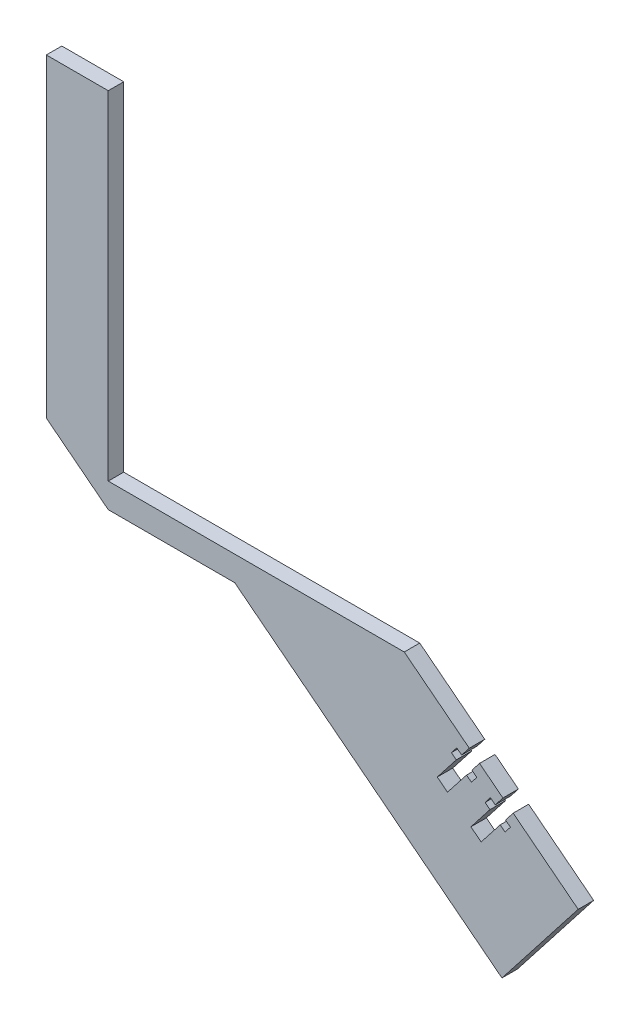
ISO-10303-21;
HEADER;
FILE_DESCRIPTION(('STEP AP214'),'2;1');
FILE_NAME('part.step','',(''),(''),'','','');
FILE_SCHEMA(('AUTOMOTIVE_DESIGN { 1 0 10303 214 1 1 1 1 }'));
ENDSEC;
DATA;
#1=APPLICATION_CONTEXT('core data for automotive mechanical design processes');
#2=APPLICATION_PROTOCOL_DEFINITION('international standard','automotive_design',2000,#1);
#3=PRODUCT_CONTEXT('',#1,'mechanical');
#4=PRODUCT('Part','Part','',(#3));
#5=PRODUCT_RELATED_PRODUCT_CATEGORY('part','',(#4));
#6=PRODUCT_DEFINITION_FORMATION('','',#4);
#7=PRODUCT_DEFINITION_CONTEXT('part definition',#1,'design');
#8=PRODUCT_DEFINITION('design','',#6,#7);
#9=PRODUCT_DEFINITION_SHAPE('','',#8);
#10=(LENGTH_UNIT() NAMED_UNIT(*) SI_UNIT(.MILLI.,.METRE.));
#11=(NAMED_UNIT(*) PLANE_ANGLE_UNIT() SI_UNIT($,.RADIAN.));
#12=(NAMED_UNIT(*) SI_UNIT($,.STERADIAN.) SOLID_ANGLE_UNIT());
#13=UNCERTAINTY_MEASURE_WITH_UNIT(LENGTH_MEASURE(1.E-05),#10,'distance_accuracy_value','');
#14=(GEOMETRIC_REPRESENTATION_CONTEXT(3) GLOBAL_UNCERTAINTY_ASSIGNED_CONTEXT((#13)) GLOBAL_UNIT_ASSIGNED_CONTEXT((#10,
#11,#12)) REPRESENTATION_CONTEXT('',''));
#15=CARTESIAN_POINT('',(0.,0.,0.));
#16=DIRECTION('',(0.,0.,1.));
#17=DIRECTION('',(1.,0.,0.));
#18=AXIS2_PLACEMENT_3D('',#15,#16,#17);
#19=CARTESIAN_POINT('',(-331.826668728988,452.478862829645,-222.99999999963));
#20=DIRECTION('',(0.615661475325659,0.788010753606722,0.));
#21=DIRECTION('',(-0.788010753606722,0.615661475325659,0.));
#22=AXIS2_PLACEMENT_3D('',#19,#20,#21);
#23=PLANE('',#22);
#24=DIRECTION('',(0.,0.,-1.));
#25=VECTOR('',#24,1.);
#26=CARTESIAN_POINT('',(-307.516612196294,433.485765081086,-217.99999999963));
#27=LINE('',#26,#25);
#28=CARTESIAN_POINT('',(-307.516612196294,433.485765081086,-217.99999999963));
#29=VERTEX_POINT('',#28);
#30=CARTESIAN_POINT('',(-307.516612196294,433.485765081086,-222.99999999963));
#31=VERTEX_POINT('',#30);
#32=EDGE_CURVE('E300',#29,#31,#27,.T.);
#33=ORIENTED_EDGE('',*,*,#32,.F.);
#34=DIRECTION('',(-0.788010753606722,0.615661475325659,0.));
#35=VECTOR('',#34,1.);
#36=CARTESIAN_POINT('',(-331.826668728988,452.478862829645,-217.99999999963));
#37=LINE('',#36,#35);
#38=CARTESIAN_POINT('',(-299.957265680182,427.579756302264,-217.99999999963));
#39=VERTEX_POINT('',#38);
#40=EDGE_CURVE('E273',#39,#29,#37,.T.);
#41=ORIENTED_EDGE('',*,*,#40,.F.);
#42=DIRECTION('',(0.,0.,-1.));
#43=VECTOR('',#42,1.);
#44=CARTESIAN_POINT('',(-299.957265680182,427.579756302264,-217.99999999963));
#45=LINE('',#44,#43);
#46=CARTESIAN_POINT('',(-299.957265680182,427.579756302264,-222.99999999963));
#47=VERTEX_POINT('',#46);
#48=EDGE_CURVE('E364',#39,#47,#45,.T.);
#49=ORIENTED_EDGE('',*,*,#48,.T.);
#50=DIRECTION('',(-0.788010753606722,0.615661475325659,0.));
#51=VECTOR('',#50,1.);
#52=CARTESIAN_POINT('',(-331.826668728988,452.478862829645,-222.99999999963));
#53=LINE('',#52,#51);
#54=EDGE_CURVE('E467',#47,#31,#53,.T.);
#55=ORIENTED_EDGE('',*,*,#54,.T.);
#56=EDGE_LOOP('',(#33,#41,#49,#55));
#57=FACE_BOUND('',#56,.T.);
#58=ADVANCED_FACE('F33',(#57),#23,.T.);
#59=DIRECTION('',(0.,0.,-1.));
#60=VECTOR('',#59,1.);
#61=CARTESIAN_POINT('',(-296.647620515035,424.993978105897,-217.99999999963));
#62=LINE('',#61,#60);
#63=CARTESIAN_POINT('',(-296.647620515035,424.993978105897,-217.99999999963));
#64=VERTEX_POINT('',#63);
#65=CARTESIAN_POINT('',(-296.647620515035,424.993978105897,-222.99999999963));
#66=VERTEX_POINT('',#65);
#67=EDGE_CURVE('E361',#64,#66,#62,.T.);
#68=ORIENTED_EDGE('',*,*,#67,.F.);
#69=CARTESIAN_POINT('',(-275.647209147489,408.586658553705,-217.99999999963));
#70=VERTEX_POINT('',#69);
#71=EDGE_CURVE('E442',#70,#64,#37,.T.);
#72=ORIENTED_EDGE('',*,*,#71,.F.);
#73=DIRECTION('',(0.,0.,1.));
#74=VECTOR('',#73,1.);
#75=CARTESIAN_POINT('',(-275.647209147489,408.586658553705,-222.99999999963));
#76=LINE('',#75,#74);
#77=CARTESIAN_POINT('',(-275.647209147489,408.586658553705,-222.99999999963));
#78=VERTEX_POINT('',#77);
#79=EDGE_CURVE('E42',#78,#70,#76,.T.);
#80=ORIENTED_EDGE('',*,*,#79,.F.);
#81=EDGE_CURVE('E464',#78,#66,#53,.T.);
#82=ORIENTED_EDGE('',*,*,#81,.T.);
#83=EDGE_LOOP('',(#68,#72,#80,#82));
#84=FACE_BOUND('',#83,.T.);
#85=ADVANCED_FACE('F549',(#84),#23,.T.);
#86=CARTESIAN_POINT('',(-331.826668728988,452.478862829645,-222.99999999963));
#87=DIRECTION('',(0.,1.,0.));
#88=DIRECTION('',(0.,0.,1.));
#89=AXIS2_PLACEMENT_3D('',#86,#87,#88);
#90=PLANE('',#89);
#91=DIRECTION('',(-1.,0.,0.));
#92=VECTOR('',#91,1.);
#93=CARTESIAN_POINT('',(-331.826668728988,452.478862829645,-217.99999999963));
#94=LINE('',#93,#92);
#95=CARTESIAN_POINT('',(-331.826668728988,452.478862829645,-217.99999999963));
#96=VERTEX_POINT('',#95);
#97=CARTESIAN_POINT('',(-427.432442284142,452.478862829645,-217.99999999963));
#98=VERTEX_POINT('',#97);
#99=EDGE_CURVE('E437',#96,#98,#94,.T.);
#100=ORIENTED_EDGE('',*,*,#99,.F.);
#101=DIRECTION('',(0.,0.,1.));
#102=VECTOR('',#101,1.);
#103=CARTESIAN_POINT('',(-331.826668728988,452.478862829645,-222.99999999963));
#104=LINE('',#103,#102);
#105=CARTESIAN_POINT('',(-331.826668728988,452.478862829645,-222.99999999963));
#106=VERTEX_POINT('',#105);
#107=EDGE_CURVE('E11',#106,#96,#104,.T.);
#108=ORIENTED_EDGE('',*,*,#107,.F.);
#109=DIRECTION('',(-1.,0.,0.));
#110=VECTOR('',#109,1.);
#111=CARTESIAN_POINT('',(-331.826668728988,452.478862829645,-222.99999999963));
#112=LINE('',#111,#110);
#113=CARTESIAN_POINT('',(-427.432442284142,452.478862829645,-222.99999999963));
#114=VERTEX_POINT('',#113);
#115=EDGE_CURVE('E438',#106,#114,#112,.T.);
#116=ORIENTED_EDGE('',*,*,#115,.T.);
#117=DIRECTION('',(0.,0.,1.));
#118=VECTOR('',#117,1.);
#119=CARTESIAN_POINT('',(-427.432442284142,452.478862829645,-222.99999999963));
#120=LINE('',#119,#118);
#121=EDGE_CURVE('E37',#114,#98,#120,.T.);
#122=ORIENTED_EDGE('',*,*,#121,.T.);
#123=EDGE_LOOP('',(#100,#108,#116,#122));
#124=FACE_BOUND('',#123,.T.);
#125=ADVANCED_FACE('F35',(#124),#90,.T.);
#126=DIRECTION('',(0.,0.,-1.));
#127=VECTOR('',#126,1.);
#128=CARTESIAN_POINT('',(-310.826257361443,436.071543277454,-217.99999999963));
#129=LINE('',#128,#127);
#130=CARTESIAN_POINT('',(-310.826257361443,436.071543277454,-217.99999999963));
#131=VERTEX_POINT('',#130);
#132=CARTESIAN_POINT('',(-310.826257361443,436.071543277454,-222.99999999963));
#133=VERTEX_POINT('',#132);
#134=EDGE_CURVE('E303',#131,#133,#129,.T.);
#135=ORIENTED_EDGE('',*,*,#134,.T.);
#136=EDGE_CURVE('E463',#133,#106,#53,.T.);
#137=ORIENTED_EDGE('',*,*,#136,.T.);
#138=ORIENTED_EDGE('',*,*,#107,.T.);
#139=EDGE_CURVE('E491',#131,#96,#37,.T.);
#140=ORIENTED_EDGE('',*,*,#139,.F.);
#141=EDGE_LOOP('',(#135,#137,#138,#140));
#142=FACE_BOUND('',#141,.T.);
#143=ADVANCED_FACE('F517',(#142),#23,.T.);
#144=CARTESIAN_POINT('',(-275.647209147489,408.586658553705,-222.99999999963));
#145=DIRECTION('',(0.788010753606722,-0.615661475325658,0.));
#146=DIRECTION('',(0.615661475325658,0.788010753606722,0.));
#147=AXIS2_PLACEMENT_3D('',#144,#145,#146);
#148=PLANE('',#147);
#149=DIRECTION('',(0.615661475325658,0.788010753606722,0.));
#150=VECTOR('',#149,1.);
#151=CARTESIAN_POINT('',(-275.647209147489,408.586658553705,-217.99999999963));
#152=LINE('',#151,#150);
#153=CARTESIAN_POINT('',(-300.273668160516,377.066228409436,-217.99999999963));
#154=VERTEX_POINT('',#153);
#155=EDGE_CURVE('E488',#154,#70,#152,.T.);
#156=ORIENTED_EDGE('',*,*,#155,.F.);
#157=DIRECTION('',(0.,0.,1.));
#158=VECTOR('',#157,1.);
#159=CARTESIAN_POINT('',(-300.273668160516,377.066228409436,-222.99999999963));
#160=LINE('',#159,#158);
#161=CARTESIAN_POINT('',(-300.273668160516,377.066228409436,-222.99999999963));
#162=VERTEX_POINT('',#161);
#163=EDGE_CURVE('E495',#162,#154,#160,.T.);
#164=ORIENTED_EDGE('',*,*,#163,.F.);
#165=DIRECTION('',(0.615661475325658,0.788010753606722,0.));
#166=VECTOR('',#165,1.);
#167=CARTESIAN_POINT('',(-275.647209147489,408.586658553705,-222.99999999963));
#168=LINE('',#167,#166);
#169=EDGE_CURVE('E460',#162,#78,#168,.T.);
#170=ORIENTED_EDGE('',*,*,#169,.T.);
#171=ORIENTED_EDGE('',*,*,#79,.T.);
#172=EDGE_LOOP('',(#156,#164,#170,#171));
#173=FACE_BOUND('',#172,.T.);
#174=ADVANCED_FACE('F545',(#173),#148,.T.);
#175=CARTESIAN_POINT('',(-300.273668160516,377.066228409436,-222.99999999963));
#176=DIRECTION('',(-0.615661475325658,-0.788010753606722,0.));
#177=DIRECTION('',(0.788010753606722,-0.615661475325659,0.));
#178=AXIS2_PLACEMENT_3D('',#175,#176,#177);
#179=PLANE('',#178);
#180=DIRECTION('',(0.788010753606722,-0.615661475325658,0.));
#181=VECTOR('',#180,1.);
#182=CARTESIAN_POINT('',(-300.273668160516,377.066228409436,-217.99999999963));
#183=LINE('',#182,#181);
#184=CARTESIAN_POINT('',(-386.557905490753,444.478862829645,-217.99999999963));
#185=VERTEX_POINT('',#184);
#186=EDGE_CURVE('E485',#185,#154,#183,.T.);
#187=ORIENTED_EDGE('',*,*,#186,.F.);
#188=DIRECTION('',(0.,0.,1.));
#189=VECTOR('',#188,1.);
#190=CARTESIAN_POINT('',(-386.557905490753,444.478862829645,-222.99999999963));
#191=LINE('',#190,#189);
#192=CARTESIAN_POINT('',(-386.557905490753,444.478862829645,-222.99999999963));
#193=VERTEX_POINT('',#192);
#194=EDGE_CURVE('E497',#193,#185,#191,.T.);
#195=ORIENTED_EDGE('',*,*,#194,.F.);
#196=DIRECTION('',(0.788010753606722,-0.615661475325658,0.));
#197=VECTOR('',#196,1.);
#198=CARTESIAN_POINT('',(-300.273668160516,377.066228409436,-222.99999999963));
#199=LINE('',#198,#197);
#200=EDGE_CURVE('E457',#193,#162,#199,.T.);
#201=ORIENTED_EDGE('',*,*,#200,.T.);
#202=ORIENTED_EDGE('',*,*,#163,.T.);
#203=EDGE_LOOP('',(#187,#195,#201,#202));
#204=FACE_BOUND('',#203,.T.);
#205=ADVANCED_FACE('F541',(#204),#179,.T.);
#206=CARTESIAN_POINT('',(-386.557905490753,444.478862829645,-222.99999999963));
#207=DIRECTION('',(0.,-1.,0.));
#208=DIRECTION('',(0.,0.,-1.));
#209=AXIS2_PLACEMENT_3D('',#206,#207,#208);
#210=PLANE('',#209);
#211=DIRECTION('',(1.,0.,0.));
#212=VECTOR('',#211,1.);
#213=CARTESIAN_POINT('',(-386.557905490753,444.478862829645,-217.99999999963));
#214=LINE('',#213,#212);
#215=CARTESIAN_POINT('',(-427.432442284142,444.478862829645,-217.99999999963));
#216=VERTEX_POINT('',#215);
#217=EDGE_CURVE('E482',#216,#185,#214,.T.);
#218=ORIENTED_EDGE('',*,*,#217,.F.);
#219=DIRECTION('',(0.,0.,1.));
#220=VECTOR('',#219,1.);
#221=CARTESIAN_POINT('',(-427.432442284142,444.478862829645,-222.99999999963));
#222=LINE('',#221,#220);
#223=CARTESIAN_POINT('',(-427.432442284142,444.478862829645,-222.99999999963));
#224=VERTEX_POINT('',#223);
#225=EDGE_CURVE('E499',#224,#216,#222,.T.);
#226=ORIENTED_EDGE('',*,*,#225,.F.);
#227=DIRECTION('',(1.,0.,0.));
#228=VECTOR('',#227,1.);
#229=CARTESIAN_POINT('',(-386.557905490753,444.478862829645,-222.99999999963));
#230=LINE('',#229,#228);
#231=EDGE_CURVE('E454',#224,#193,#230,.T.);
#232=ORIENTED_EDGE('',*,*,#231,.T.);
#233=ORIENTED_EDGE('',*,*,#194,.T.);
#234=EDGE_LOOP('',(#218,#226,#232,#233));
#235=FACE_BOUND('',#234,.T.);
#236=ADVANCED_FACE('F536',(#235),#210,.T.);
#237=CARTESIAN_POINT('',(-427.432442284142,444.478862829645,-222.99999999963));
#238=DIRECTION('',(-0.615661475325659,-0.788010753606721,0.));
#239=DIRECTION('',(0.788010753606721,-0.615661475325659,0.));
#240=AXIS2_PLACEMENT_3D('',#237,#238,#239);
#241=PLANE('',#240);
#242=DIRECTION('',(0.788010753606721,-0.615661475325659,0.));
#243=VECTOR('',#242,1.);
#244=CARTESIAN_POINT('',(-427.432442284142,444.478862829645,-217.99999999963));
#245=LINE('',#244,#243);
#246=CARTESIAN_POINT('',(-447.432442284142,460.10457535978,-217.99999999963));
#247=VERTEX_POINT('',#246);
#248=EDGE_CURVE('E479',#247,#216,#245,.T.);
#249=ORIENTED_EDGE('',*,*,#248,.F.);
#250=DIRECTION('',(0.,0.,1.));
#251=VECTOR('',#250,1.);
#252=CARTESIAN_POINT('',(-447.432442284142,460.10457535978,-222.99999999963));
#253=LINE('',#252,#251);
#254=CARTESIAN_POINT('',(-447.432442284142,460.10457535978,-222.99999999963));
#255=VERTEX_POINT('',#254);
#256=EDGE_CURVE('E501',#255,#247,#253,.T.);
#257=ORIENTED_EDGE('',*,*,#256,.F.);
#258=DIRECTION('',(0.788010753606721,-0.615661475325659,0.));
#259=VECTOR('',#258,1.);
#260=CARTESIAN_POINT('',(-427.432442284142,444.478862829645,-222.99999999963));
#261=LINE('',#260,#259);
#262=EDGE_CURVE('E451',#255,#224,#261,.T.);
#263=ORIENTED_EDGE('',*,*,#262,.T.);
#264=ORIENTED_EDGE('',*,*,#225,.T.);
#265=EDGE_LOOP('',(#249,#257,#263,#264));
#266=FACE_BOUND('',#265,.T.);
#267=ADVANCED_FACE('F532',(#266),#241,.T.);
#268=CARTESIAN_POINT('',(-447.432442284145,561.679955314006,-222.99999999963));
#269=DIRECTION('',(-1.,0.,0.));
#270=DIRECTION('',(0.,-1.,0.));
#271=AXIS2_PLACEMENT_3D('',#268,#269,#270);
#272=PLANE('',#271);
#273=DIRECTION('',(0.,-1.,0.));
#274=VECTOR('',#273,1.);
#275=CARTESIAN_POINT('',(-447.432442284145,561.679955314006,-217.99999999963));
#276=LINE('',#275,#274);
#277=CARTESIAN_POINT('',(-447.432442284145,561.679955314006,-217.99999999963));
#278=VERTEX_POINT('',#277);
#279=EDGE_CURVE('E476',#278,#247,#276,.T.);
#280=ORIENTED_EDGE('',*,*,#279,.F.);
#281=DIRECTION('',(0.,0.,1.));
#282=VECTOR('',#281,1.);
#283=CARTESIAN_POINT('',(-447.432442284145,561.679955314006,-222.99999999963));
#284=LINE('',#283,#282);
#285=CARTESIAN_POINT('',(-447.432442284145,561.679955314006,-222.99999999963));
#286=VERTEX_POINT('',#285);
#287=EDGE_CURVE('E503',#286,#278,#284,.T.);
#288=ORIENTED_EDGE('',*,*,#287,.F.);
#289=DIRECTION('',(0.,-1.,0.));
#290=VECTOR('',#289,1.);
#291=CARTESIAN_POINT('',(-447.432442284145,561.679955314006,-222.99999999963));
#292=LINE('',#291,#290);
#293=EDGE_CURVE('E448',#286,#255,#292,.T.);
#294=ORIENTED_EDGE('',*,*,#293,.T.);
#295=ORIENTED_EDGE('',*,*,#256,.T.);
#296=EDGE_LOOP('',(#280,#288,#294,#295));
#297=FACE_BOUND('',#296,.T.);
#298=ADVANCED_FACE('F530',(#297),#272,.T.);
#299=CARTESIAN_POINT('',(-427.432442284145,561.679955314007,-222.99999999963));
#300=DIRECTION('',(0.,1.,0.));
#301=DIRECTION('',(-1.,0.,0.));
#302=AXIS2_PLACEMENT_3D('',#299,#300,#301);
#303=PLANE('',#302);
#304=DIRECTION('',(-1.,0.,0.));
#305=VECTOR('',#304,1.);
#306=CARTESIAN_POINT('',(-427.432442284145,561.679955314007,-217.99999999963));
#307=LINE('',#306,#305);
#308=CARTESIAN_POINT('',(-427.432442284145,561.679955314007,-217.99999999963));
#309=VERTEX_POINT('',#308);
#310=EDGE_CURVE('E473',#309,#278,#307,.T.);
#311=ORIENTED_EDGE('',*,*,#310,.F.);
#312=DIRECTION('',(0.,0.,1.));
#313=VECTOR('',#312,1.);
#314=CARTESIAN_POINT('',(-427.432442284145,561.679955314007,-222.99999999963));
#315=LINE('',#314,#313);
#316=CARTESIAN_POINT('',(-427.432442284145,561.679955314007,-222.99999999963));
#317=VERTEX_POINT('',#316);
#318=EDGE_CURVE('E504',#317,#309,#315,.T.);
#319=ORIENTED_EDGE('',*,*,#318,.F.);
#320=DIRECTION('',(-1.,0.,0.));
#321=VECTOR('',#320,1.);
#322=CARTESIAN_POINT('',(-427.432442284145,561.679955314007,-222.99999999963));
#323=LINE('',#322,#321);
#324=EDGE_CURVE('E445',#317,#286,#323,.T.);
#325=ORIENTED_EDGE('',*,*,#324,.T.);
#326=ORIENTED_EDGE('',*,*,#287,.T.);
#327=EDGE_LOOP('',(#311,#319,#325,#326));
#328=FACE_BOUND('',#327,.T.);
#329=ADVANCED_FACE('F526',(#328),#303,.T.);
#330=CARTESIAN_POINT('',(-427.432442284142,452.478862829645,-222.99999999963));
#331=DIRECTION('',(1.,0.,0.));
#332=DIRECTION('',(0.,1.,0.));
#333=AXIS2_PLACEMENT_3D('',#330,#331,#332);
#334=PLANE('',#333);
#335=DIRECTION('',(0.,1.,0.));
#336=VECTOR('',#335,1.);
#337=CARTESIAN_POINT('',(-427.432442284142,452.478862829645,-217.99999999963));
#338=LINE('',#337,#336);
#339=EDGE_CURVE('E470',#98,#309,#338,.T.);
#340=ORIENTED_EDGE('',*,*,#339,.F.);
#341=ORIENTED_EDGE('',*,*,#121,.F.);
#342=DIRECTION('',(0.,1.,0.));
#343=VECTOR('',#342,1.);
#344=CARTESIAN_POINT('',(-427.432442284142,452.478862829645,-222.99999999963));
#345=LINE('',#344,#343);
#346=EDGE_CURVE('E441',#114,#317,#345,.T.);
#347=ORIENTED_EDGE('',*,*,#346,.T.);
#348=ORIENTED_EDGE('',*,*,#318,.T.);
#349=EDGE_LOOP('',(#340,#341,#347,#348));
#350=FACE_BOUND('',#349,.T.);
#351=ADVANCED_FACE('F513',(#350),#334,.T.);
#352=CARTESIAN_POINT('',(0.,0.,-222.99999999963));
#353=DIRECTION('',(0.,0.,-1.));
#354=DIRECTION('',(-1.,0.,0.));
#355=AXIS2_PLACEMENT_3D('',#352,#353,#354);
#356=PLANE('',#355);
#357=DIRECTION('',(-0.61566147532565,-0.788010753606729,0.));
#358=VECTOR('',#357,1.);
#359=CARTESIAN_POINT('',(-401.260499603436,313.499060825062,-222.99999999963));
#360=LINE('',#359,#358);
#361=CARTESIAN_POINT('',(-309.979258097597,430.333722066659,-222.99999999963));
#362=VERTEX_POINT('',#361);
#363=EDGE_CURVE('E258',#31,#362,#360,.T.);
#364=ORIENTED_EDGE('',*,*,#363,.F.);
#365=ORIENTED_EDGE('',*,*,#54,.F.);
#366=DIRECTION('',(0.615661475325665,0.788010753606717,0.));
#367=VECTOR('',#366,1.);
#368=CARTESIAN_POINT('',(-393.701153087321,307.59305204625,-222.99999999963));
#369=LINE('',#368,#367);
#370=CARTESIAN_POINT('',(-302.419911581485,424.427713287837,-222.99999999963));
#371=VERTEX_POINT('',#370);
#372=EDGE_CURVE('E412',#371,#47,#369,.T.);
#373=ORIENTED_EDGE('',*,*,#372,.F.);
#374=DIRECTION('',(0.788010753606721,-0.61566147532566,0.));
#375=VECTOR('',#374,1.);
#376=CARTESIAN_POINT('',(91.2812415058367,116.834661241591,-222.99999999963));
#377=LINE('',#376,#375);
#378=CARTESIAN_POINT('',(-303.9959330887,425.65903623849,-222.99999999963));
#379=VERTEX_POINT('',#378);
#380=EDGE_CURVE('E410',#379,#371,#377,.T.);
#381=ORIENTED_EDGE('',*,*,#380,.F.);
#382=DIRECTION('',(0.615661475325154,0.788010753607116,0.));
#383=VECTOR('',#382,1.);
#384=CARTESIAN_POINT('',(-395.27717459466,308.824374996586,-222.99999999963));
#385=LINE('',#384,#383);
#386=CARTESIAN_POINT('',(-305.71978521961,423.45260612839,-222.99999999963));
#387=VERTEX_POINT('',#386);
#388=EDGE_CURVE('E408',#387,#379,#385,.T.);
#389=ORIENTED_EDGE('',*,*,#388,.F.);
#390=DIRECTION('',(-0.788010753606703,0.615661475325683,0.));
#391=VECTOR('',#390,1.);
#392=CARTESIAN_POINT('',(89.5573893749193,114.628231131478,-222.99999999963));
#393=LINE('',#392,#391);
#394=CARTESIAN_POINT('',(-304.143763712397,422.221283177738,-222.99999999963));
#395=VERTEX_POINT('',#394);
#396=EDGE_CURVE('E406',#395,#387,#393,.T.);
#397=ORIENTED_EDGE('',*,*,#396,.F.);
#398=DIRECTION('',(0.615661475325624,0.788010753606749,0.));
#399=VECTOR('',#398,1.);
#400=CARTESIAN_POINT('',(-393.701153087331,307.593052046224,-222.99999999963));
#401=LINE('',#400,#399);
#402=CARTESIAN_POINT('',(-310.300378465653,414.341175641671,-222.99999999963));
#403=VERTEX_POINT('',#402);
#404=EDGE_CURVE('E404',#403,#395,#401,.T.);
#405=ORIENTED_EDGE('',*,*,#404,.F.);
#406=DIRECTION('',(-0.788010753606721,0.61566147532566,0.));
#407=VECTOR('',#406,1.);
#408=CARTESIAN_POINT('',(83.4007746216682,106.748123595425,-222.99999999963));
#409=LINE('',#408,#407);
#410=CARTESIAN_POINT('',(-306.990733300505,411.755397445304,-222.99999999963));
#411=VERTEX_POINT('',#410);
#412=EDGE_CURVE('E402',#411,#403,#409,.T.);
#413=ORIENTED_EDGE('',*,*,#412,.F.);
#414=DIRECTION('',(-0.615661475325708,-0.788010753606683,0.));
#415=VECTOR('',#414,1.);
#416=CARTESIAN_POINT('',(-390.391507922162,305.007273849908,-222.99999999963));
#417=LINE('',#416,#415);
#418=CARTESIAN_POINT('',(-300.834118547248,419.63550498137,-222.99999999963));
#419=VERTEX_POINT('',#418);
#420=EDGE_CURVE('E400',#419,#411,#417,.T.);
#421=ORIENTED_EDGE('',*,*,#420,.F.);
#422=DIRECTION('',(-0.788010753606726,0.615661475325653,0.));
#423=VECTOR('',#422,1.);
#424=CARTESIAN_POINT('',(89.5573893749265,114.628231131496,-222.99999999963));
#425=LINE('',#424,#423);
#426=CARTESIAN_POINT('',(-299.258097040034,418.404182030719,-222.99999999963));
#427=VERTEX_POINT('',#426);
#428=EDGE_CURVE('E398',#427,#419,#425,.T.);
#429=ORIENTED_EDGE('',*,*,#428,.F.);
#430=DIRECTION('',(-0.615661475325659,-0.788010753606721,0.));
#431=VECTOR('',#430,1.);
#432=CARTESIAN_POINT('',(-388.815486414959,303.775950899226,-222.99999999963));
#433=LINE('',#432,#431);
#434=CARTESIAN_POINT('',(-297.534244909122,420.610612140818,-222.99999999963));
#435=VERTEX_POINT('',#434);
#436=EDGE_CURVE('E396',#435,#427,#433,.T.);
#437=ORIENTED_EDGE('',*,*,#436,.F.);
#438=DIRECTION('',(0.788010753606728,-0.615661475325651,0.));
#439=VECTOR('',#438,1.);
#440=CARTESIAN_POINT('',(91.2812415058389,116.834661241596,-222.99999999963));
#441=LINE('',#440,#439);
#442=CARTESIAN_POINT('',(-299.110266416337,421.841935091469,-222.99999999963));
#443=VERTEX_POINT('',#442);
#444=EDGE_CURVE('E363',#443,#435,#441,.T.);
#445=ORIENTED_EDGE('',*,*,#444,.F.);
#446=DIRECTION('',(-0.615661475325298,-0.788010753607004,0.));
#447=VECTOR('',#446,1.);
#448=CARTESIAN_POINT('',(-390.39150792226,305.007273849657,-222.99999999963));
#449=LINE('',#448,#447);
#450=EDGE_CURVE('E414',#66,#443,#449,.T.);
#451=ORIENTED_EDGE('',*,*,#450,.F.);
#452=ORIENTED_EDGE('',*,*,#81,.F.);
#453=ORIENTED_EDGE('',*,*,#169,.F.);
#454=ORIENTED_EDGE('',*,*,#200,.F.);
#455=ORIENTED_EDGE('',*,*,#231,.F.);
#456=ORIENTED_EDGE('',*,*,#262,.F.);
#457=ORIENTED_EDGE('',*,*,#293,.F.);
#458=ORIENTED_EDGE('',*,*,#324,.F.);
#459=ORIENTED_EDGE('',*,*,#346,.F.);
#460=ORIENTED_EDGE('',*,*,#115,.F.);
#461=ORIENTED_EDGE('',*,*,#136,.F.);
#462=DIRECTION('',(0.61566147532565,0.788010753606729,0.));
#463=VECTOR('',#462,1.);
#464=CARTESIAN_POINT('',(-404.570144768585,316.08483902143,-222.99999999963));
#465=LINE('',#464,#463);
#466=CARTESIAN_POINT('',(-313.288903262746,432.919500263027,-222.99999999963));
#467=VERTEX_POINT('',#466);
#468=EDGE_CURVE('E434',#467,#133,#465,.T.);
#469=ORIENTED_EDGE('',*,*,#468,.F.);
#470=DIRECTION('',(0.788010753606705,-0.61566147532568,0.));
#471=VECTOR('',#470,1.);
#472=CARTESIAN_POINT('',(91.2812415058315,116.834661241578,-222.99999999963));
#473=LINE('',#472,#471);
#474=CARTESIAN_POINT('',(-314.864924769959,434.150823213679,-222.99999999963));
#475=VERTEX_POINT('',#474);
#476=EDGE_CURVE('E432',#475,#467,#473,.T.);
#477=ORIENTED_EDGE('',*,*,#476,.F.);
#478=DIRECTION('',(0.615661475325669,0.788010753606714,0.));
#479=VECTOR('',#478,1.);
#480=CARTESIAN_POINT('',(-406.146166275793,317.316161972093,-222.99999999963));
#481=LINE('',#480,#479);
#482=CARTESIAN_POINT('',(-316.588776900871,431.94439310358,-222.99999999963));
#483=VERTEX_POINT('',#482);
#484=EDGE_CURVE('E430',#483,#475,#481,.T.);
#485=ORIENTED_EDGE('',*,*,#484,.F.);
#486=DIRECTION('',(-0.788010753606718,0.615661475325663,0.));
#487=VECTOR('',#486,1.);
#488=CARTESIAN_POINT('',(89.557389374924,114.62823113149,-222.99999999963));
#489=LINE('',#488,#487);
#490=CARTESIAN_POINT('',(-315.012755393657,430.713070152928,-222.99999999963));
#491=VERTEX_POINT('',#490);
#492=EDGE_CURVE('E428',#491,#483,#489,.T.);
#493=ORIENTED_EDGE('',*,*,#492,.F.);
#494=DIRECTION('',(0.615661475325614,0.788010753606757,0.));
#495=VECTOR('',#494,1.);
#496=CARTESIAN_POINT('',(-404.570144768594,316.084839021408,-222.99999999963));
#497=LINE('',#496,#495);
#498=CARTESIAN_POINT('',(-321.169370146914,422.832962616861,-222.99999999963));
#499=VERTEX_POINT('',#498);
#500=EDGE_CURVE('E426',#499,#491,#497,.T.);
#501=ORIENTED_EDGE('',*,*,#500,.F.);
#502=DIRECTION('',(-0.788010753606726,0.615661475325654,0.));
#503=VECTOR('',#502,1.);
#504=CARTESIAN_POINT('',(83.4007746216699,106.748123595428,-222.99999999963));
#505=LINE('',#504,#503);
#506=CARTESIAN_POINT('',(-317.859724981766,420.247184420493,-222.99999999963));
#507=VERTEX_POINT('',#506);
#508=EDGE_CURVE('E424',#507,#499,#505,.T.);
#509=ORIENTED_EDGE('',*,*,#508,.F.);
#510=DIRECTION('',(-0.615661475325661,-0.78801075360672,0.));
#511=VECTOR('',#510,1.);
#512=CARTESIAN_POINT('',(-401.260499603434,313.499060825069,-222.99999999963));
#513=LINE('',#512,#511);
#514=CARTESIAN_POINT('',(-311.703110228509,428.127291956561,-222.99999999963));
#515=VERTEX_POINT('',#514);
#516=EDGE_CURVE('E422',#515,#507,#513,.T.);
#517=ORIENTED_EDGE('',*,*,#516,.F.);
#518=DIRECTION('',(-0.788010753606745,0.615661475325629,0.));
#519=VECTOR('',#518,1.);
#520=CARTESIAN_POINT('',(89.5573893749327,114.628231131511,-222.99999999963));
#521=LINE('',#520,#519);
#522=CARTESIAN_POINT('',(-310.127088721296,426.895969005909,-222.99999999963));
#523=VERTEX_POINT('',#522);
#524=EDGE_CURVE('E420',#523,#515,#521,.T.);
#525=ORIENTED_EDGE('',*,*,#524,.F.);
#526=DIRECTION('',(-0.615661475325654,-0.788010753606725,0.));
#527=VECTOR('',#526,1.);
#528=CARTESIAN_POINT('',(-399.684478096222,312.267737874414,-222.99999999963));
#529=LINE('',#528,#527);
#530=CARTESIAN_POINT('',(-308.403236590384,429.102399116008,-222.99999999963));
#531=VERTEX_POINT('',#530);
#532=EDGE_CURVE('E418',#531,#523,#529,.T.);
#533=ORIENTED_EDGE('',*,*,#532,.F.);
#534=DIRECTION('',(0.788010753606712,-0.615661475325671,0.));
#535=VECTOR('',#534,1.);
#536=CARTESIAN_POINT('',(91.2812415058339,116.834661241584,-222.99999999963));
#537=LINE('',#536,#535);
#538=EDGE_CURVE('E416',#362,#531,#537,.T.);
#539=ORIENTED_EDGE('',*,*,#538,.F.);
#540=EDGE_LOOP('',(#364,#365,#373,#381,#389,#397,#405,#413,#421,#429,#437,#445,#451,#452,#453,
#454,#455,#456,#457,#458,#459,#460,#461,#469,#477,#485,#493,#501,#509,#517,#525,#533,#539));
#541=FACE_BOUND('',#540,.T.);
#542=ADVANCED_FACE('F520',(#541),#356,.T.);
#543=CARTESIAN_POINT('',(0.,0.,-217.99999999963));
#544=DIRECTION('',(0.,0.,-1.));
#545=DIRECTION('',(-1.,0.,0.));
#546=AXIS2_PLACEMENT_3D('',#543,#544,#545);
#547=PLANE('',#546);
#548=ORIENTED_EDGE('',*,*,#40,.T.);
#549=DIRECTION('',(-0.61566147532565,-0.788010753606729,0.));
#550=VECTOR('',#549,1.);
#551=CARTESIAN_POINT('',(-307.516612196294,433.485765081086,-217.99999999963));
#552=LINE('',#551,#550);
#553=CARTESIAN_POINT('',(-309.979258097597,430.333722066659,-217.99999999963));
#554=VERTEX_POINT('',#553);
#555=EDGE_CURVE('E255',#29,#554,#552,.T.);
#556=ORIENTED_EDGE('',*,*,#555,.T.);
#557=DIRECTION('',(0.788010753606712,-0.615661475325671,0.));
#558=VECTOR('',#557,1.);
#559=CARTESIAN_POINT('',(-309.979258097597,430.333722066659,-217.99999999963));
#560=LINE('',#559,#558);
#561=CARTESIAN_POINT('',(-308.403236590384,429.102399116008,-217.99999999963));
#562=VERTEX_POINT('',#561);
#563=EDGE_CURVE('E265',#554,#562,#560,.T.);
#564=ORIENTED_EDGE('',*,*,#563,.T.);
#565=DIRECTION('',(-0.615661475325654,-0.788010753606725,0.));
#566=VECTOR('',#565,1.);
#567=CARTESIAN_POINT('',(-308.403236590384,429.102399116008,-217.99999999963));
#568=LINE('',#567,#566);
#569=CARTESIAN_POINT('',(-310.127088721296,426.895969005909,-217.99999999963));
#570=VERTEX_POINT('',#569);
#571=EDGE_CURVE('E50',#562,#570,#568,.T.);
#572=ORIENTED_EDGE('',*,*,#571,.T.);
#573=DIRECTION('',(-0.788010753606745,0.615661475325629,0.));
#574=VECTOR('',#573,1.);
#575=CARTESIAN_POINT('',(-311.703110228509,428.127291956561,-217.99999999963));
#576=LINE('',#575,#574);
#577=CARTESIAN_POINT('',(-311.703110228509,428.127291956561,-217.99999999963));
#578=VERTEX_POINT('',#577);
#579=EDGE_CURVE('E277',#570,#578,#576,.T.);
#580=ORIENTED_EDGE('',*,*,#579,.T.);
#581=DIRECTION('',(-0.61566147532566,-0.78801075360672,0.));
#582=VECTOR('',#581,1.);
#583=CARTESIAN_POINT('',(-311.703110228509,428.127291956561,-217.99999999963));
#584=LINE('',#583,#582);
#585=CARTESIAN_POINT('',(-317.859724981766,420.247184420493,-217.99999999963));
#586=VERTEX_POINT('',#585);
#587=EDGE_CURVE('E280',#578,#586,#584,.T.);
#588=ORIENTED_EDGE('',*,*,#587,.T.);
#589=DIRECTION('',(-0.788010753606726,0.615661475325654,0.));
#590=VECTOR('',#589,1.);
#591=CARTESIAN_POINT('',(-321.169370146914,422.832962616861,-217.99999999963));
#592=LINE('',#591,#590);
#593=CARTESIAN_POINT('',(-321.169370146914,422.832962616861,-217.99999999963));
#594=VERTEX_POINT('',#593);
#595=EDGE_CURVE('E283',#586,#594,#592,.T.);
#596=ORIENTED_EDGE('',*,*,#595,.T.);
#597=DIRECTION('',(0.615661475325614,0.788010753606757,0.));
#598=VECTOR('',#597,1.);
#599=CARTESIAN_POINT('',(-315.012755393657,430.713070152928,-217.99999999963));
#600=LINE('',#599,#598);
#601=CARTESIAN_POINT('',(-315.012755393657,430.713070152928,-217.99999999963));
#602=VERTEX_POINT('',#601);
#603=EDGE_CURVE('E286',#594,#602,#600,.T.);
#604=ORIENTED_EDGE('',*,*,#603,.T.);
#605=DIRECTION('',(-0.788010753606718,0.615661475325663,0.));
#606=VECTOR('',#605,1.);
#607=CARTESIAN_POINT('',(-316.588776900871,431.94439310358,-217.99999999963));
#608=LINE('',#607,#606);
#609=CARTESIAN_POINT('',(-316.588776900871,431.94439310358,-217.99999999963));
#610=VERTEX_POINT('',#609);
#611=EDGE_CURVE('E289',#602,#610,#608,.T.);
#612=ORIENTED_EDGE('',*,*,#611,.T.);
#613=DIRECTION('',(0.615661475325669,0.788010753606714,0.));
#614=VECTOR('',#613,1.);
#615=CARTESIAN_POINT('',(-314.864924769959,434.150823213679,-217.99999999963));
#616=LINE('',#615,#614);
#617=CARTESIAN_POINT('',(-314.864924769959,434.150823213679,-217.99999999963));
#618=VERTEX_POINT('',#617);
#619=EDGE_CURVE('E292',#610,#618,#616,.T.);
#620=ORIENTED_EDGE('',*,*,#619,.T.);
#621=DIRECTION('',(0.788010753606705,-0.61566147532568,0.));
#622=VECTOR('',#621,1.);
#623=CARTESIAN_POINT('',(-314.864924769959,434.150823213679,-217.99999999963));
#624=LINE('',#623,#622);
#625=CARTESIAN_POINT('',(-313.288903262746,432.919500263027,-217.99999999963));
#626=VERTEX_POINT('',#625);
#627=EDGE_CURVE('E295',#618,#626,#624,.T.);
#628=ORIENTED_EDGE('',*,*,#627,.T.);
#629=DIRECTION('',(0.61566147532565,0.788010753606729,0.));
#630=VECTOR('',#629,1.);
#631=CARTESIAN_POINT('',(-310.826257361443,436.071543277454,-217.99999999963));
#632=LINE('',#631,#630);
#633=EDGE_CURVE('E262',#626,#131,#632,.T.);
#634=ORIENTED_EDGE('',*,*,#633,.T.);
#635=ORIENTED_EDGE('',*,*,#139,.T.);
#636=ORIENTED_EDGE('',*,*,#99,.T.);
#637=ORIENTED_EDGE('',*,*,#339,.T.);
#638=ORIENTED_EDGE('',*,*,#310,.T.);
#639=ORIENTED_EDGE('',*,*,#279,.T.);
#640=ORIENTED_EDGE('',*,*,#248,.T.);
#641=ORIENTED_EDGE('',*,*,#217,.T.);
#642=ORIENTED_EDGE('',*,*,#186,.T.);
#643=ORIENTED_EDGE('',*,*,#155,.T.);
#644=ORIENTED_EDGE('',*,*,#71,.T.);
#645=DIRECTION('',(-0.615661475325298,-0.788010753607004,0.));
#646=VECTOR('',#645,1.);
#647=CARTESIAN_POINT('',(-296.647620515035,424.993978105897,-217.99999999963));
#648=LINE('',#647,#646);
#649=CARTESIAN_POINT('',(-299.110266416337,421.841935091469,-217.99999999963));
#650=VERTEX_POINT('',#649);
#651=EDGE_CURVE('E302',#64,#650,#648,.T.);
#652=ORIENTED_EDGE('',*,*,#651,.T.);
#653=DIRECTION('',(0.788010753606728,-0.615661475325651,0.));
#654=VECTOR('',#653,1.);
#655=CARTESIAN_POINT('',(-297.534244909122,420.610612140818,-217.99999999963));
#656=LINE('',#655,#654);
#657=CARTESIAN_POINT('',(-297.534244909122,420.610612140818,-217.99999999963));
#658=VERTEX_POINT('',#657);
#659=EDGE_CURVE('E333',#650,#658,#656,.T.);
#660=ORIENTED_EDGE('',*,*,#659,.T.);
#661=DIRECTION('',(-0.615661475325659,-0.788010753606721,0.));
#662=VECTOR('',#661,1.);
#663=CARTESIAN_POINT('',(-297.534244909122,420.610612140818,-217.99999999963));
#664=LINE('',#663,#662);
#665=CARTESIAN_POINT('',(-299.258097040034,418.404182030719,-217.99999999963));
#666=VERTEX_POINT('',#665);
#667=EDGE_CURVE('E58',#658,#666,#664,.T.);
#668=ORIENTED_EDGE('',*,*,#667,.T.);
#669=DIRECTION('',(-0.788010753606726,0.615661475325653,0.));
#670=VECTOR('',#669,1.);
#671=CARTESIAN_POINT('',(-299.258097040034,418.404182030719,-217.99999999963));
#672=LINE('',#671,#670);
#673=CARTESIAN_POINT('',(-300.834118547248,419.63550498137,-217.99999999963));
#674=VERTEX_POINT('',#673);
#675=EDGE_CURVE('E337',#666,#674,#672,.T.);
#676=ORIENTED_EDGE('',*,*,#675,.T.);
#677=DIRECTION('',(-0.615661475325708,-0.788010753606683,0.));
#678=VECTOR('',#677,1.);
#679=CARTESIAN_POINT('',(-300.834118547248,419.63550498137,-217.99999999963));
#680=LINE('',#679,#678);
#681=CARTESIAN_POINT('',(-306.990733300505,411.755397445304,-217.99999999963));
#682=VERTEX_POINT('',#681);
#683=EDGE_CURVE('E340',#674,#682,#680,.T.);
#684=ORIENTED_EDGE('',*,*,#683,.T.);
#685=DIRECTION('',(-0.788010753606721,0.61566147532566,0.));
#686=VECTOR('',#685,1.);
#687=CARTESIAN_POINT('',(-306.990733300505,411.755397445304,-217.99999999963));
#688=LINE('',#687,#686);
#689=CARTESIAN_POINT('',(-310.300378465653,414.341175641671,-217.99999999963));
#690=VERTEX_POINT('',#689);
#691=EDGE_CURVE('E343',#682,#690,#688,.T.);
#692=ORIENTED_EDGE('',*,*,#691,.T.);
#693=DIRECTION('',(0.615661475325624,0.788010753606749,0.));
#694=VECTOR('',#693,1.);
#695=CARTESIAN_POINT('',(-304.143763712397,422.221283177738,-217.99999999963));
#696=LINE('',#695,#694);
#697=CARTESIAN_POINT('',(-304.143763712397,422.221283177738,-217.99999999963));
#698=VERTEX_POINT('',#697);
#699=EDGE_CURVE('E346',#690,#698,#696,.T.);
#700=ORIENTED_EDGE('',*,*,#699,.T.);
#701=DIRECTION('',(-0.788010753606703,0.615661475325683,0.));
#702=VECTOR('',#701,1.);
#703=CARTESIAN_POINT('',(-304.143763712397,422.221283177738,-217.99999999963));
#704=LINE('',#703,#702);
#705=CARTESIAN_POINT('',(-305.71978521961,423.45260612839,-217.99999999963));
#706=VERTEX_POINT('',#705);
#707=EDGE_CURVE('E349',#698,#706,#704,.T.);
#708=ORIENTED_EDGE('',*,*,#707,.T.);
#709=DIRECTION('',(0.615661475325154,0.788010753607116,0.));
#710=VECTOR('',#709,1.);
#711=CARTESIAN_POINT('',(-303.9959330887,425.65903623849,-217.99999999963));
#712=LINE('',#711,#710);
#713=CARTESIAN_POINT('',(-303.9959330887,425.65903623849,-217.99999999963));
#714=VERTEX_POINT('',#713);
#715=EDGE_CURVE('E352',#706,#714,#712,.T.);
#716=ORIENTED_EDGE('',*,*,#715,.T.);
#717=DIRECTION('',(0.788010753606721,-0.61566147532566,0.));
#718=VECTOR('',#717,1.);
#719=CARTESIAN_POINT('',(-302.419911581485,424.427713287837,-217.99999999963));
#720=LINE('',#719,#718);
#721=CARTESIAN_POINT('',(-302.419911581485,424.427713287837,-217.99999999963));
#722=VERTEX_POINT('',#721);
#723=EDGE_CURVE('E355',#714,#722,#720,.T.);
#724=ORIENTED_EDGE('',*,*,#723,.T.);
#725=DIRECTION('',(0.615661475325665,0.788010753606717,0.));
#726=VECTOR('',#725,1.);
#727=CARTESIAN_POINT('',(-299.957265680182,427.579756302264,-217.99999999963));
#728=LINE('',#727,#726);
#729=EDGE_CURVE('E358',#722,#39,#728,.T.);
#730=ORIENTED_EDGE('',*,*,#729,.T.);
#731=EDGE_LOOP('',(#548,#556,#564,#572,#580,#588,#596,#604,#612,#620,#628,#634,#635,#636,#637,
#638,#639,#640,#641,#642,#643,#644,#652,#660,#668,#676,#684,#692,#700,#708,#716,#724,#730));
#732=FACE_BOUND('',#731,.T.);
#733=ADVANCED_FACE('F270',(#732),#547,.F.);
#734=CARTESIAN_POINT('',(-296.647620515035,424.993978105897,-217.99999999963));
#735=DIRECTION('',(0.788010753607004,-0.615661475325298,0.));
#736=DIRECTION('',(0.615661475325298,0.788010753607004,0.));
#737=AXIS2_PLACEMENT_3D('',#734,#735,#736);
#738=PLANE('',#737);
#739=ORIENTED_EDGE('',*,*,#450,.T.);
#740=DIRECTION('',(0.,0.,-1.));
#741=VECTOR('',#740,1.);
#742=CARTESIAN_POINT('',(-299.110266416337,421.841935091469,-217.99999999963));
#743=LINE('',#742,#741);
#744=EDGE_CURVE('E360',#650,#443,#743,.T.);
#745=ORIENTED_EDGE('',*,*,#744,.F.);
#746=ORIENTED_EDGE('',*,*,#651,.F.);
#747=ORIENTED_EDGE('',*,*,#67,.T.);
#748=EDGE_LOOP('',(#739,#745,#746,#747));
#749=FACE_BOUND('',#748,.T.);
#750=ADVANCED_FACE('F552',(#749),#738,.F.);
#751=CARTESIAN_POINT('',(-299.957265680182,427.579756302264,-217.99999999963));
#752=DIRECTION('',(-0.788010753606717,0.615661475325665,0.));
#753=DIRECTION('',(-0.615661475325665,-0.788010753606717,0.));
#754=AXIS2_PLACEMENT_3D('',#751,#752,#753);
#755=PLANE('',#754);
#756=ORIENTED_EDGE('',*,*,#372,.T.);
#757=ORIENTED_EDGE('',*,*,#48,.F.);
#758=ORIENTED_EDGE('',*,*,#729,.F.);
#759=DIRECTION('',(0.,0.,-1.));
#760=VECTOR('',#759,1.);
#761=CARTESIAN_POINT('',(-302.419911581485,424.427713287837,-217.99999999963));
#762=LINE('',#761,#760);
#763=EDGE_CURVE('E367',#722,#371,#762,.T.);
#764=ORIENTED_EDGE('',*,*,#763,.T.);
#765=EDGE_LOOP('',(#756,#757,#758,#764));
#766=FACE_BOUND('',#765,.T.);
#767=ADVANCED_FACE('F590',(#766),#755,.F.);
#768=CARTESIAN_POINT('',(-302.419911581485,424.427713287837,-217.99999999963));
#769=DIRECTION('',(0.61566147532566,0.788010753606721,0.));
#770=DIRECTION('',(-0.788010753606721,0.61566147532566,0.));
#771=AXIS2_PLACEMENT_3D('',#768,#769,#770);
#772=PLANE('',#771);
#773=ORIENTED_EDGE('',*,*,#380,.T.);
#774=ORIENTED_EDGE('',*,*,#763,.F.);
#775=ORIENTED_EDGE('',*,*,#723,.F.);
#776=DIRECTION('',(0.,0.,-1.));
#777=VECTOR('',#776,1.);
#778=CARTESIAN_POINT('',(-303.9959330887,425.65903623849,-217.99999999963));
#779=LINE('',#778,#777);
#780=EDGE_CURVE('E370',#714,#379,#779,.T.);
#781=ORIENTED_EDGE('',*,*,#780,.T.);
#782=EDGE_LOOP('',(#773,#774,#775,#781));
#783=FACE_BOUND('',#782,.T.);
#784=ADVANCED_FACE('F586',(#783),#772,.F.);
#785=CARTESIAN_POINT('',(-303.9959330887,425.65903623849,-217.99999999963));
#786=DIRECTION('',(-0.788010753607116,0.615661475325154,0.));
#787=DIRECTION('',(-0.615661475325154,-0.788010753607116,0.));
#788=AXIS2_PLACEMENT_3D('',#785,#786,#787);
#789=PLANE('',#788);
#790=ORIENTED_EDGE('',*,*,#388,.T.);
#791=ORIENTED_EDGE('',*,*,#780,.F.);
#792=ORIENTED_EDGE('',*,*,#715,.F.);
#793=DIRECTION('',(0.,0.,-1.));
#794=VECTOR('',#793,1.);
#795=CARTESIAN_POINT('',(-305.71978521961,423.45260612839,-217.99999999963));
#796=LINE('',#795,#794);
#797=EDGE_CURVE('E373',#706,#387,#796,.T.);
#798=ORIENTED_EDGE('',*,*,#797,.T.);
#799=EDGE_LOOP('',(#790,#791,#792,#798));
#800=FACE_BOUND('',#799,.T.);
#801=ADVANCED_FACE('F582',(#800),#789,.F.);
#802=CARTESIAN_POINT('',(-304.143763712397,422.221283177738,-217.99999999963));
#803=DIRECTION('',(-0.615661475325683,-0.788010753606703,0.));
#804=DIRECTION('',(0.788010753606703,-0.615661475325683,0.));
#805=AXIS2_PLACEMENT_3D('',#802,#803,#804);
#806=PLANE('',#805);
#807=ORIENTED_EDGE('',*,*,#396,.T.);
#808=ORIENTED_EDGE('',*,*,#797,.F.);
#809=ORIENTED_EDGE('',*,*,#707,.F.);
#810=DIRECTION('',(0.,0.,-1.));
#811=VECTOR('',#810,1.);
#812=CARTESIAN_POINT('',(-304.143763712397,422.221283177738,-217.99999999963));
#813=LINE('',#812,#811);
#814=EDGE_CURVE('E376',#698,#395,#813,.T.);
#815=ORIENTED_EDGE('',*,*,#814,.T.);
#816=EDGE_LOOP('',(#807,#808,#809,#815));
#817=FACE_BOUND('',#816,.T.);
#818=ADVANCED_FACE('F578',(#817),#806,.F.);
#819=CARTESIAN_POINT('',(-304.143763712397,422.221283177738,-217.99999999963));
#820=DIRECTION('',(-0.788010753606749,0.615661475325624,0.));
#821=DIRECTION('',(-0.615661475325624,-0.788010753606749,0.));
#822=AXIS2_PLACEMENT_3D('',#819,#820,#821);
#823=PLANE('',#822);
#824=ORIENTED_EDGE('',*,*,#404,.T.);
#825=ORIENTED_EDGE('',*,*,#814,.F.);
#826=ORIENTED_EDGE('',*,*,#699,.F.);
#827=DIRECTION('',(0.,0.,-1.));
#828=VECTOR('',#827,1.);
#829=CARTESIAN_POINT('',(-310.300378465653,414.341175641671,-217.99999999963));
#830=LINE('',#829,#828);
#831=EDGE_CURVE('E379',#690,#403,#830,.T.);
#832=ORIENTED_EDGE('',*,*,#831,.T.);
#833=EDGE_LOOP('',(#824,#825,#826,#832));
#834=FACE_BOUND('',#833,.T.);
#835=ADVANCED_FACE('F574',(#834),#823,.F.);
#836=CARTESIAN_POINT('',(-306.990733300505,411.755397445304,-217.99999999963));
#837=DIRECTION('',(-0.61566147532566,-0.788010753606721,0.));
#838=DIRECTION('',(0.788010753606721,-0.61566147532566,0.));
#839=AXIS2_PLACEMENT_3D('',#836,#837,#838);
#840=PLANE('',#839);
#841=ORIENTED_EDGE('',*,*,#412,.T.);
#842=ORIENTED_EDGE('',*,*,#831,.F.);
#843=ORIENTED_EDGE('',*,*,#691,.F.);
#844=DIRECTION('',(0.,0.,-1.));
#845=VECTOR('',#844,1.);
#846=CARTESIAN_POINT('',(-306.990733300505,411.755397445304,-217.99999999963));
#847=LINE('',#846,#845);
#848=EDGE_CURVE('E382',#682,#411,#847,.T.);
#849=ORIENTED_EDGE('',*,*,#848,.T.);
#850=EDGE_LOOP('',(#841,#842,#843,#849));
#851=FACE_BOUND('',#850,.T.);
#852=ADVANCED_FACE('F571',(#851),#840,.F.);
#853=CARTESIAN_POINT('',(-300.834118547248,419.63550498137,-217.99999999963));
#854=DIRECTION('',(0.788010753606683,-0.615661475325708,0.));
#855=DIRECTION('',(0.615661475325708,0.788010753606683,0.));
#856=AXIS2_PLACEMENT_3D('',#853,#854,#855);
#857=PLANE('',#856);
#858=ORIENTED_EDGE('',*,*,#420,.T.);
#859=ORIENTED_EDGE('',*,*,#848,.F.);
#860=ORIENTED_EDGE('',*,*,#683,.F.);
#861=DIRECTION('',(0.,0.,-1.));
#862=VECTOR('',#861,1.);
#863=CARTESIAN_POINT('',(-300.834118547248,419.63550498137,-217.99999999963));
#864=LINE('',#863,#862);
#865=EDGE_CURVE('E385',#674,#419,#864,.T.);
#866=ORIENTED_EDGE('',*,*,#865,.T.);
#867=EDGE_LOOP('',(#858,#859,#860,#866));
#868=FACE_BOUND('',#867,.T.);
#869=ADVANCED_FACE('F567',(#868),#857,.F.);
#870=CARTESIAN_POINT('',(-299.258097040034,418.404182030719,-217.99999999963));
#871=DIRECTION('',(-0.615661475325653,-0.788010753606726,0.));
#872=DIRECTION('',(0.788010753606726,-0.615661475325653,0.));
#873=AXIS2_PLACEMENT_3D('',#870,#871,#872);
#874=PLANE('',#873);
#875=ORIENTED_EDGE('',*,*,#428,.T.);
#876=ORIENTED_EDGE('',*,*,#865,.F.);
#877=ORIENTED_EDGE('',*,*,#675,.F.);
#878=DIRECTION('',(0.,0.,-1.));
#879=VECTOR('',#878,1.);
#880=CARTESIAN_POINT('',(-299.258097040034,418.404182030719,-217.99999999963));
#881=LINE('',#880,#879);
#882=EDGE_CURVE('E388',#666,#427,#881,.T.);
#883=ORIENTED_EDGE('',*,*,#882,.T.);
#884=EDGE_LOOP('',(#875,#876,#877,#883));
#885=FACE_BOUND('',#884,.T.);
#886=ADVANCED_FACE('F563',(#885),#874,.F.);
#887=CARTESIAN_POINT('',(-297.534244909122,420.610612140818,-217.99999999963));
#888=DIRECTION('',(0.788010753606721,-0.615661475325659,0.));
#889=DIRECTION('',(0.615661475325659,0.788010753606721,0.));
#890=AXIS2_PLACEMENT_3D('',#887,#888,#889);
#891=PLANE('',#890);
#892=ORIENTED_EDGE('',*,*,#436,.T.);
#893=ORIENTED_EDGE('',*,*,#882,.F.);
#894=ORIENTED_EDGE('',*,*,#667,.F.);
#895=DIRECTION('',(0.,0.,-1.));
#896=VECTOR('',#895,1.);
#897=CARTESIAN_POINT('',(-297.534244909122,420.610612140818,-217.99999999963));
#898=LINE('',#897,#896);
#899=EDGE_CURVE('E391',#658,#435,#898,.T.);
#900=ORIENTED_EDGE('',*,*,#899,.T.);
#901=EDGE_LOOP('',(#892,#893,#894,#900));
#902=FACE_BOUND('',#901,.T.);
#903=ADVANCED_FACE('F558',(#902),#891,.F.);
#904=CARTESIAN_POINT('',(-297.534244909122,420.610612140818,-217.99999999963));
#905=DIRECTION('',(0.615661475325651,0.788010753606728,0.));
#906=DIRECTION('',(-0.788010753606728,0.615661475325651,0.));
#907=AXIS2_PLACEMENT_3D('',#904,#905,#906);
#908=PLANE('',#907);
#909=ORIENTED_EDGE('',*,*,#444,.T.);
#910=ORIENTED_EDGE('',*,*,#899,.F.);
#911=ORIENTED_EDGE('',*,*,#659,.F.);
#912=ORIENTED_EDGE('',*,*,#744,.T.);
#913=EDGE_LOOP('',(#909,#910,#911,#912));
#914=FACE_BOUND('',#913,.T.);
#915=ADVANCED_FACE('F556',(#914),#908,.F.);
#916=CARTESIAN_POINT('',(-307.516612196294,433.485765081086,-217.99999999963));
#917=DIRECTION('',(0.788010753606729,-0.61566147532565,0.));
#918=DIRECTION('',(0.61566147532565,0.788010753606729,0.));
#919=AXIS2_PLACEMENT_3D('',#916,#917,#918);
#920=PLANE('',#919);
#921=ORIENTED_EDGE('',*,*,#363,.T.);
#922=DIRECTION('',(0.,0.,-1.));
#923=VECTOR('',#922,1.);
#924=CARTESIAN_POINT('',(-309.979258097597,430.333722066659,-217.99999999963));
#925=LINE('',#924,#923);
#926=EDGE_CURVE('E251',#554,#362,#925,.T.);
#927=ORIENTED_EDGE('',*,*,#926,.F.);
#928=ORIENTED_EDGE('',*,*,#555,.F.);
#929=ORIENTED_EDGE('',*,*,#32,.T.);
#930=EDGE_LOOP('',(#921,#927,#928,#929));
#931=FACE_BOUND('',#930,.T.);
#932=ADVANCED_FACE('F253',(#931),#920,.F.);
#933=CARTESIAN_POINT('',(-310.826257361443,436.071543277454,-217.99999999963));
#934=DIRECTION('',(-0.788010753606729,0.61566147532565,0.));
#935=DIRECTION('',(-0.61566147532565,-0.788010753606729,0.));
#936=AXIS2_PLACEMENT_3D('',#933,#934,#935);
#937=PLANE('',#936);
#938=ORIENTED_EDGE('',*,*,#468,.T.);
#939=ORIENTED_EDGE('',*,*,#134,.F.);
#940=ORIENTED_EDGE('',*,*,#633,.F.);
#941=DIRECTION('',(0.,0.,-1.));
#942=VECTOR('',#941,1.);
#943=CARTESIAN_POINT('',(-313.288903262746,432.919500263027,-217.99999999963));
#944=LINE('',#943,#942);
#945=EDGE_CURVE('E306',#626,#467,#944,.T.);
#946=ORIENTED_EDGE('',*,*,#945,.T.);
#947=EDGE_LOOP('',(#938,#939,#940,#946));
#948=FACE_BOUND('',#947,.T.);
#949=ADVANCED_FACE('F625',(#948),#937,.F.);
#950=CARTESIAN_POINT('',(-314.864924769959,434.150823213679,-217.99999999963));
#951=DIRECTION('',(0.61566147532568,0.788010753606705,0.));
#952=DIRECTION('',(-0.788010753606705,0.61566147532568,0.));
#953=AXIS2_PLACEMENT_3D('',#950,#951,#952);
#954=PLANE('',#953);
#955=ORIENTED_EDGE('',*,*,#476,.T.);
#956=ORIENTED_EDGE('',*,*,#945,.F.);
#957=ORIENTED_EDGE('',*,*,#627,.F.);
#958=DIRECTION('',(0.,0.,-1.));
#959=VECTOR('',#958,1.);
#960=CARTESIAN_POINT('',(-314.864924769959,434.150823213679,-217.99999999963));
#961=LINE('',#960,#959);
#962=EDGE_CURVE('E309',#618,#475,#961,.T.);
#963=ORIENTED_EDGE('',*,*,#962,.T.);
#964=EDGE_LOOP('',(#955,#956,#957,#963));
#965=FACE_BOUND('',#964,.T.);
#966=ADVANCED_FACE('F622',(#965),#954,.F.);
#967=CARTESIAN_POINT('',(-314.864924769959,434.150823213679,-217.99999999963));
#968=DIRECTION('',(-0.788010753606714,0.615661475325669,0.));
#969=DIRECTION('',(-0.615661475325669,-0.788010753606714,0.));
#970=AXIS2_PLACEMENT_3D('',#967,#968,#969);
#971=PLANE('',#970);
#972=ORIENTED_EDGE('',*,*,#484,.T.);
#973=ORIENTED_EDGE('',*,*,#962,.F.);
#974=ORIENTED_EDGE('',*,*,#619,.F.);
#975=DIRECTION('',(0.,0.,-1.));
#976=VECTOR('',#975,1.);
#977=CARTESIAN_POINT('',(-316.588776900871,431.94439310358,-217.99999999963));
#978=LINE('',#977,#976);
#979=EDGE_CURVE('E312',#610,#483,#978,.T.);
#980=ORIENTED_EDGE('',*,*,#979,.T.);
#981=EDGE_LOOP('',(#972,#973,#974,#980));
#982=FACE_BOUND('',#981,.T.);
#983=ADVANCED_FACE('F619',(#982),#971,.F.);
#984=CARTESIAN_POINT('',(-316.588776900871,431.94439310358,-217.99999999963));
#985=DIRECTION('',(-0.615661475325663,-0.788010753606718,0.));
#986=DIRECTION('',(0.788010753606718,-0.615661475325663,0.));
#987=AXIS2_PLACEMENT_3D('',#984,#985,#986);
#988=PLANE('',#987);
#989=ORIENTED_EDGE('',*,*,#492,.T.);
#990=ORIENTED_EDGE('',*,*,#979,.F.);
#991=ORIENTED_EDGE('',*,*,#611,.F.);
#992=DIRECTION('',(0.,0.,-1.));
#993=VECTOR('',#992,1.);
#994=CARTESIAN_POINT('',(-315.012755393657,430.713070152928,-217.99999999963));
#995=LINE('',#994,#993);
#996=EDGE_CURVE('E315',#602,#491,#995,.T.);
#997=ORIENTED_EDGE('',*,*,#996,.T.);
#998=EDGE_LOOP('',(#989,#990,#991,#997));
#999=FACE_BOUND('',#998,.T.);
#1000=ADVANCED_FACE('F615',(#999),#988,.F.);
#1001=CARTESIAN_POINT('',(-315.012755393657,430.713070152928,-217.99999999963));
#1002=DIRECTION('',(-0.788010753606757,0.615661475325614,0.));
#1003=DIRECTION('',(-0.615661475325614,-0.788010753606757,0.));
#1004=AXIS2_PLACEMENT_3D('',#1001,#1002,#1003);
#1005=PLANE('',#1004);
#1006=ORIENTED_EDGE('',*,*,#500,.T.);
#1007=ORIENTED_EDGE('',*,*,#996,.F.);
#1008=ORIENTED_EDGE('',*,*,#603,.F.);
#1009=DIRECTION('',(0.,0.,-1.));
#1010=VECTOR('',#1009,1.);
#1011=CARTESIAN_POINT('',(-321.169370146914,422.832962616861,-217.99999999963));
#1012=LINE('',#1011,#1010);
#1013=EDGE_CURVE('E318',#594,#499,#1012,.T.);
#1014=ORIENTED_EDGE('',*,*,#1013,.T.);
#1015=EDGE_LOOP('',(#1006,#1007,#1008,#1014));
#1016=FACE_BOUND('',#1015,.T.);
#1017=ADVANCED_FACE('F612',(#1016),#1005,.F.);
#1018=CARTESIAN_POINT('',(-321.169370146914,422.832962616861,-217.99999999963));
#1019=DIRECTION('',(-0.615661475325654,-0.788010753606726,0.));
#1020=DIRECTION('',(0.788010753606726,-0.615661475325654,0.));
#1021=AXIS2_PLACEMENT_3D('',#1018,#1019,#1020);
#1022=PLANE('',#1021);
#1023=ORIENTED_EDGE('',*,*,#508,.T.);
#1024=ORIENTED_EDGE('',*,*,#1013,.F.);
#1025=ORIENTED_EDGE('',*,*,#595,.F.);
#1026=DIRECTION('',(0.,0.,-1.));
#1027=VECTOR('',#1026,1.);
#1028=CARTESIAN_POINT('',(-317.859724981766,420.247184420493,-217.99999999963));
#1029=LINE('',#1028,#1027);
#1030=EDGE_CURVE('E321',#586,#507,#1029,.T.);
#1031=ORIENTED_EDGE('',*,*,#1030,.T.);
#1032=EDGE_LOOP('',(#1023,#1024,#1025,#1031));
#1033=FACE_BOUND('',#1032,.T.);
#1034=ADVANCED_FACE('F608',(#1033),#1022,.F.);
#1035=CARTESIAN_POINT('',(-311.703110228509,428.127291956561,-217.99999999963));
#1036=DIRECTION('',(0.78801075360672,-0.615661475325661,0.));
#1037=DIRECTION('',(0.615661475325661,0.78801075360672,0.));
#1038=AXIS2_PLACEMENT_3D('',#1035,#1036,#1037);
#1039=PLANE('',#1038);
#1040=ORIENTED_EDGE('',*,*,#516,.T.);
#1041=ORIENTED_EDGE('',*,*,#1030,.F.);
#1042=ORIENTED_EDGE('',*,*,#587,.F.);
#1043=DIRECTION('',(0.,0.,-1.));
#1044=VECTOR('',#1043,1.);
#1045=CARTESIAN_POINT('',(-311.703110228509,428.127291956561,-217.99999999963));
#1046=LINE('',#1045,#1044);
#1047=EDGE_CURVE('E324',#578,#515,#1046,.T.);
#1048=ORIENTED_EDGE('',*,*,#1047,.T.);
#1049=EDGE_LOOP('',(#1040,#1041,#1042,#1048));
#1050=FACE_BOUND('',#1049,.T.);
#1051=ADVANCED_FACE('F604',(#1050),#1039,.F.);
#1052=CARTESIAN_POINT('',(-311.703110228509,428.127291956561,-217.99999999963));
#1053=DIRECTION('',(-0.615661475325629,-0.788010753606745,0.));
#1054=DIRECTION('',(0.788010753606745,-0.615661475325629,0.));
#1055=AXIS2_PLACEMENT_3D('',#1052,#1053,#1054);
#1056=PLANE('',#1055);
#1057=ORIENTED_EDGE('',*,*,#524,.T.);
#1058=ORIENTED_EDGE('',*,*,#1047,.F.);
#1059=ORIENTED_EDGE('',*,*,#579,.F.);
#1060=DIRECTION('',(0.,0.,-1.));
#1061=VECTOR('',#1060,1.);
#1062=CARTESIAN_POINT('',(-310.127088721296,426.895969005909,-217.99999999963));
#1063=LINE('',#1062,#1061);
#1064=EDGE_CURVE('E327',#570,#523,#1063,.T.);
#1065=ORIENTED_EDGE('',*,*,#1064,.T.);
#1066=EDGE_LOOP('',(#1057,#1058,#1059,#1065));
#1067=FACE_BOUND('',#1066,.T.);
#1068=ADVANCED_FACE('F599',(#1067),#1056,.F.);
#1069=CARTESIAN_POINT('',(-308.403236590384,429.102399116008,-217.99999999963));
#1070=DIRECTION('',(0.788010753606725,-0.615661475325654,0.));
#1071=DIRECTION('',(0.615661475325654,0.788010753606725,0.));
#1072=AXIS2_PLACEMENT_3D('',#1069,#1070,#1071);
#1073=PLANE('',#1072);
#1074=ORIENTED_EDGE('',*,*,#532,.T.);
#1075=ORIENTED_EDGE('',*,*,#1064,.F.);
#1076=ORIENTED_EDGE('',*,*,#571,.F.);
#1077=DIRECTION('',(0.,0.,-1.));
#1078=VECTOR('',#1077,1.);
#1079=CARTESIAN_POINT('',(-308.403236590384,429.102399116008,-217.99999999963));
#1080=LINE('',#1079,#1078);
#1081=EDGE_CURVE('E261',#562,#531,#1080,.T.);
#1082=ORIENTED_EDGE('',*,*,#1081,.T.);
#1083=EDGE_LOOP('',(#1074,#1075,#1076,#1082));
#1084=FACE_BOUND('',#1083,.T.);
#1085=ADVANCED_FACE('F596',(#1084),#1073,.F.);
#1086=CARTESIAN_POINT('',(-309.979258097597,430.333722066659,-217.99999999963));
#1087=DIRECTION('',(0.615661475325671,0.788010753606712,0.));
#1088=DIRECTION('',(-0.788010753606712,0.615661475325671,0.));
#1089=AXIS2_PLACEMENT_3D('',#1086,#1087,#1088);
#1090=PLANE('',#1089);
#1091=ORIENTED_EDGE('',*,*,#538,.T.);
#1092=ORIENTED_EDGE('',*,*,#1081,.F.);
#1093=ORIENTED_EDGE('',*,*,#563,.F.);
#1094=ORIENTED_EDGE('',*,*,#926,.T.);
#1095=EDGE_LOOP('',(#1091,#1092,#1093,#1094));
#1096=FACE_BOUND('',#1095,.T.);
#1097=ADVANCED_FACE('F266',(#1096),#1090,.F.);
#1098=CLOSED_SHELL('',(#58,#85,#125,#143,#174,#205,#236,#267,#298,#329,#351,#542,#733,#750,#767,
#784,#801,#818,#835,#852,#869,#886,#903,#915,#932,#949,#966,#983,#1000,#1017,#1034,#1051,#1068,
#1085,#1097));
#1099=MANIFOLD_SOLID_BREP('B2',#1098);
#1100=ADVANCED_BREP_SHAPE_REPRESENTATION('',(#18,#1099),#14);
#1101=SHAPE_DEFINITION_REPRESENTATION(#9,#1100);
ENDSEC;
END-ISO-10303-21;
